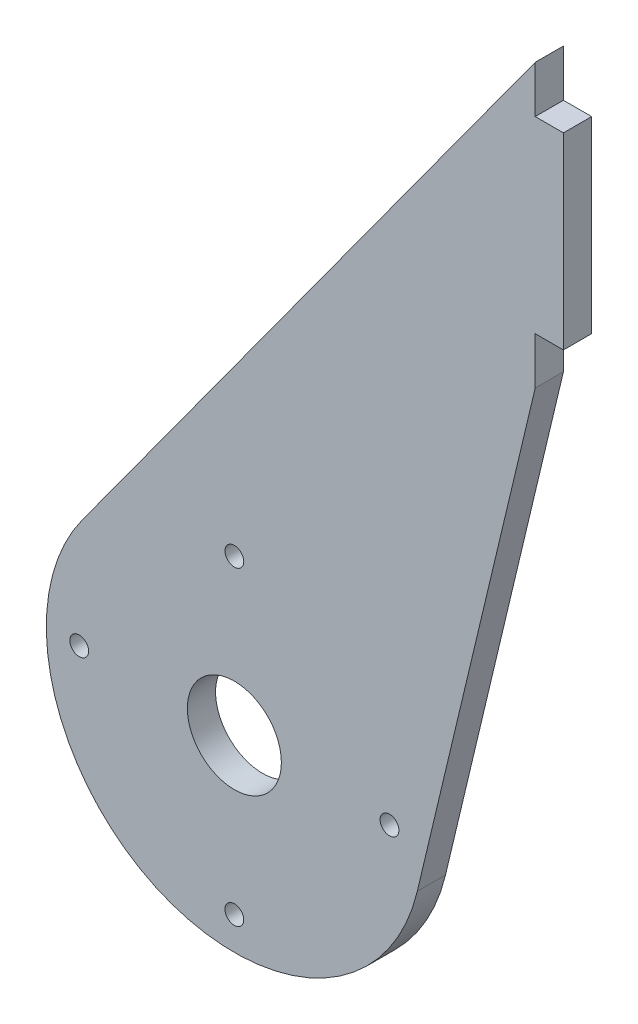
ISO-10303-21;
HEADER;
FILE_DESCRIPTION(('STEP AP214'),'2;1');
FILE_NAME('part.step','',(''),(''),'','','');
FILE_SCHEMA(('AUTOMOTIVE_DESIGN { 1 0 10303 214 1 1 1 1 }'));
ENDSEC;
DATA;
#1=APPLICATION_CONTEXT('core data for automotive mechanical design processes');
#2=APPLICATION_PROTOCOL_DEFINITION('international standard','automotive_design',2000,#1);
#3=PRODUCT_CONTEXT('',#1,'mechanical');
#4=PRODUCT('Part','Part','',(#3));
#5=PRODUCT_RELATED_PRODUCT_CATEGORY('part','',(#4));
#6=PRODUCT_DEFINITION_FORMATION('','',#4);
#7=PRODUCT_DEFINITION_CONTEXT('part definition',#1,'design');
#8=PRODUCT_DEFINITION('design','',#6,#7);
#9=PRODUCT_DEFINITION_SHAPE('','',#8);
#10=(LENGTH_UNIT() NAMED_UNIT(*) SI_UNIT(.MILLI.,.METRE.));
#11=(NAMED_UNIT(*) PLANE_ANGLE_UNIT() SI_UNIT($,.RADIAN.));
#12=(NAMED_UNIT(*) SI_UNIT($,.STERADIAN.) SOLID_ANGLE_UNIT());
#13=UNCERTAINTY_MEASURE_WITH_UNIT(LENGTH_MEASURE(1.E-05),#10,'distance_accuracy_value','');
#14=(GEOMETRIC_REPRESENTATION_CONTEXT(3) GLOBAL_UNCERTAINTY_ASSIGNED_CONTEXT((#13)) GLOBAL_UNIT_ASSIGNED_CONTEXT((#10,
#11,#12)) REPRESENTATION_CONTEXT('',''));
#15=CARTESIAN_POINT('',(0.,0.,0.));
#16=DIRECTION('',(0.,0.,1.));
#17=DIRECTION('',(1.,0.,0.));
#18=AXIS2_PLACEMENT_3D('',#15,#16,#17);
#19=CARTESIAN_POINT('',(32.,78.,-3.));
#20=DIRECTION('',(1.,0.,0.));
#21=DIRECTION('',(0.,0.,-1.));
#22=AXIS2_PLACEMENT_3D('',#19,#20,#21);
#23=PLANE('',#22);
#24=DIRECTION('',(0.,0.,1.));
#25=VECTOR('',#24,1.);
#26=CARTESIAN_POINT('',(32.,73.,0.));
#27=LINE('',#26,#25);
#28=CARTESIAN_POINT('',(32.,73.,-3.));
#29=VERTEX_POINT('',#28);
#30=CARTESIAN_POINT('',(32.,73.,0.));
#31=VERTEX_POINT('',#30);
#32=EDGE_CURVE('E50',#29,#31,#27,.T.);
#33=ORIENTED_EDGE('',*,*,#32,.F.);
#34=DIRECTION('',(0.,1.,0.));
#35=VECTOR('',#34,1.);
#36=CARTESIAN_POINT('',(32.,78.,-3.));
#37=LINE('',#36,#35);
#38=CARTESIAN_POINT('',(32.,78.,-3.));
#39=VERTEX_POINT('',#38);
#40=EDGE_CURVE('E180',#29,#39,#37,.T.);
#41=ORIENTED_EDGE('',*,*,#40,.T.);
#42=DIRECTION('',(0.,0.,1.));
#43=VECTOR('',#42,1.);
#44=CARTESIAN_POINT('',(32.,78.,-3.));
#45=LINE('',#44,#43);
#46=CARTESIAN_POINT('',(32.,78.,0.));
#47=VERTEX_POINT('',#46);
#48=EDGE_CURVE('E42',#39,#47,#45,.T.);
#49=ORIENTED_EDGE('',*,*,#48,.T.);
#50=DIRECTION('',(0.,1.,0.));
#51=VECTOR('',#50,1.);
#52=CARTESIAN_POINT('',(32.,78.,0.));
#53=LINE('',#52,#51);
#54=EDGE_CURVE('E55',#31,#47,#53,.T.);
#55=ORIENTED_EDGE('',*,*,#54,.F.);
#56=EDGE_LOOP('',(#33,#41,#49,#55));
#57=FACE_BOUND('',#56,.T.);
#58=ADVANCED_FACE('F33',(#57),#23,.T.);
#59=CARTESIAN_POINT('',(0.,0.,-3.));
#60=DIRECTION('',(0.,0.,1.));
#61=DIRECTION('',(1.,0.,0.));
#62=AXIS2_PLACEMENT_3D('',#59,#60,#61);
#63=CYLINDRICAL_SURFACE('',#62,20.);
#64=CARTESIAN_POINT('',(0.,0.,0.));
#65=DIRECTION('',(0.,0.,1.));
#66=DIRECTION('',(1.,0.,0.));
#67=AXIS2_PLACEMENT_3D('',#64,#65,#66);
#68=CIRCLE('',#67,20.);
#69=CARTESIAN_POINT('',(-16.1744111187009,11.7638609717747,0.));
#70=VERTEX_POINT('',#69);
#71=CARTESIAN_POINT('',(19.4550952982331,-4.63673019882206,0.));
#72=VERTEX_POINT('',#71);
#73=EDGE_CURVE('E170',#70,#72,#68,.T.);
#74=ORIENTED_EDGE('',*,*,#73,.F.);
#75=DIRECTION('',(0.,0.,1.));
#76=VECTOR('',#75,1.);
#77=CARTESIAN_POINT('',(-16.1744111187009,11.7638609717747,-3.));
#78=LINE('',#77,#76);
#79=CARTESIAN_POINT('',(-16.1744111187009,11.7638609717747,-3.));
#80=VERTEX_POINT('',#79);
#81=EDGE_CURVE('E11',#80,#70,#78,.T.);
#82=ORIENTED_EDGE('',*,*,#81,.F.);
#83=CARTESIAN_POINT('',(0.,0.,-3.));
#84=DIRECTION('',(0.,0.,1.));
#85=DIRECTION('',(1.,0.,0.));
#86=AXIS2_PLACEMENT_3D('',#83,#84,#85);
#87=CIRCLE('',#86,20.);
#88=CARTESIAN_POINT('',(19.4550952982331,-4.63673019882206,-3.));
#89=VERTEX_POINT('',#88);
#90=EDGE_CURVE('E173',#80,#89,#87,.T.);
#91=ORIENTED_EDGE('',*,*,#90,.T.);
#92=DIRECTION('',(0.,0.,1.));
#93=VECTOR('',#92,1.);
#94=CARTESIAN_POINT('',(19.4550952982331,-4.63673019882206,-3.));
#95=LINE('',#94,#93);
#96=EDGE_CURVE('E203',#89,#72,#95,.T.);
#97=ORIENTED_EDGE('',*,*,#96,.T.);
#98=EDGE_LOOP('',(#74,#82,#91,#97));
#99=FACE_BOUND('',#98,.T.);
#100=ADVANCED_FACE('F35',(#99),#63,.T.);
#101=CARTESIAN_POINT('',(-16.1744111187009,11.7638609717747,-3.));
#102=DIRECTION('',(-0.808720555935045,0.588193048588736,0.));
#103=DIRECTION('',(-0.588193048588736,-0.808720555935045,0.));
#104=AXIS2_PLACEMENT_3D('',#101,#102,#103);
#105=PLANE('',#104);
#106=DIRECTION('',(-0.588193048588736,-0.808720555935045,0.));
#107=VECTOR('',#106,1.);
#108=CARTESIAN_POINT('',(-16.1744111187009,11.7638609717747,0.));
#109=LINE('',#108,#107);
#110=EDGE_CURVE('E177',#47,#70,#109,.T.);
#111=ORIENTED_EDGE('',*,*,#110,.F.);
#112=ORIENTED_EDGE('',*,*,#48,.F.);
#113=DIRECTION('',(-0.588193048588736,-0.808720555935045,0.));
#114=VECTOR('',#113,1.);
#115=CARTESIAN_POINT('',(-16.1744111187009,11.7638609717747,-3.));
#116=LINE('',#115,#114);
#117=EDGE_CURVE('E183',#39,#80,#116,.T.);
#118=ORIENTED_EDGE('',*,*,#117,.T.);
#119=ORIENTED_EDGE('',*,*,#81,.T.);
#120=EDGE_LOOP('',(#111,#112,#118,#119));
#121=FACE_BOUND('',#120,.T.);
#122=ADVANCED_FACE('F212',(#121),#105,.T.);
#123=DIRECTION('',(0.,0.,-1.));
#124=VECTOR('',#123,1.);
#125=CARTESIAN_POINT('',(32.,53.,0.));
#126=LINE('',#125,#124);
#127=CARTESIAN_POINT('',(32.,53.,0.));
#128=VERTEX_POINT('',#127);
#129=CARTESIAN_POINT('',(32.,53.,-3.));
#130=VERTEX_POINT('',#129);
#131=EDGE_CURVE('E138',#128,#130,#126,.T.);
#132=ORIENTED_EDGE('',*,*,#131,.F.);
#133=CARTESIAN_POINT('',(32.,48.,0.));
#134=VERTEX_POINT('',#133);
#135=EDGE_CURVE('E123',#134,#128,#53,.T.);
#136=ORIENTED_EDGE('',*,*,#135,.F.);
#137=DIRECTION('',(0.,0.,1.));
#138=VECTOR('',#137,1.);
#139=CARTESIAN_POINT('',(32.,48.,-3.));
#140=LINE('',#139,#138);
#141=CARTESIAN_POINT('',(32.,48.,-3.));
#142=VERTEX_POINT('',#141);
#143=EDGE_CURVE('E202',#142,#134,#140,.T.);
#144=ORIENTED_EDGE('',*,*,#143,.F.);
#145=EDGE_CURVE('E189',#142,#130,#37,.T.);
#146=ORIENTED_EDGE('',*,*,#145,.T.);
#147=EDGE_LOOP('',(#132,#136,#144,#146));
#148=FACE_BOUND('',#147,.T.);
#149=ADVANCED_FACE('F222',(#148),#23,.T.);
#150=CARTESIAN_POINT('',(32.,48.,-3.));
#151=DIRECTION('',(0.972754764911655,-0.231836509941103,0.));
#152=DIRECTION('',(0.231836509941103,0.972754764911655,0.));
#153=AXIS2_PLACEMENT_3D('',#150,#151,#152);
#154=PLANE('',#153);
#155=DIRECTION('',(0.231836509941103,0.972754764911655,0.));
#156=VECTOR('',#155,1.);
#157=CARTESIAN_POINT('',(32.,48.,0.));
#158=LINE('',#157,#156);
#159=EDGE_CURVE('E193',#72,#134,#158,.T.);
#160=ORIENTED_EDGE('',*,*,#159,.F.);
#161=ORIENTED_EDGE('',*,*,#96,.F.);
#162=DIRECTION('',(0.231836509941103,0.972754764911655,0.));
#163=VECTOR('',#162,1.);
#164=CARTESIAN_POINT('',(32.,48.,-3.));
#165=LINE('',#164,#163);
#166=EDGE_CURVE('E176',#89,#142,#165,.T.);
#167=ORIENTED_EDGE('',*,*,#166,.T.);
#168=ORIENTED_EDGE('',*,*,#143,.T.);
#169=EDGE_LOOP('',(#160,#161,#167,#168));
#170=FACE_BOUND('',#169,.T.);
#171=ADVANCED_FACE('F228',(#170),#154,.T.);
#172=CARTESIAN_POINT('',(0.,0.,-3.));
#173=DIRECTION('',(0.,0.,1.));
#174=DIRECTION('',(1.,0.,0.));
#175=AXIS2_PLACEMENT_3D('',#172,#173,#174);
#176=PLANE('',#175);
#177=CARTESIAN_POINT('',(0.,0.,-3.));
#178=DIRECTION('',(0.,0.,1.));
#179=DIRECTION('',(1.,0.,0.));
#180=AXIS2_PLACEMENT_3D('',#177,#178,#179);
#181=CIRCLE('',#180,5.);
#182=CARTESIAN_POINT('',(5.,0.,-3.));
#183=VERTEX_POINT('',#182);
#184=EDGE_CURVE('E127',#183,#183,#181,.T.);
#185=ORIENTED_EDGE('',*,*,#184,.T.);
#186=EDGE_LOOP('',(#185));
#187=FACE_BOUND('',#186,.T.);
#188=CARTESIAN_POINT('',(16.5,0.,-3.));
#189=DIRECTION('',(0.,0.,1.));
#190=DIRECTION('',(1.,0.,0.));
#191=AXIS2_PLACEMENT_3D('',#188,#189,#190);
#192=CIRCLE('',#191,1.);
#193=CARTESIAN_POINT('',(17.5,0.,-3.));
#194=VERTEX_POINT('',#193);
#195=EDGE_CURVE('E149',#194,#194,#192,.T.);
#196=ORIENTED_EDGE('',*,*,#195,.T.);
#197=EDGE_LOOP('',(#196));
#198=FACE_BOUND('',#197,.T.);
#199=CARTESIAN_POINT('',(0.,-16.5,-3.));
#200=DIRECTION('',(0.,0.,1.));
#201=DIRECTION('',(1.,0.,0.));
#202=AXIS2_PLACEMENT_3D('',#199,#200,#201);
#203=CIRCLE('',#202,1.);
#204=CARTESIAN_POINT('',(1.,-16.5,-3.));
#205=VERTEX_POINT('',#204);
#206=EDGE_CURVE('E155',#205,#205,#203,.T.);
#207=ORIENTED_EDGE('',*,*,#206,.T.);
#208=EDGE_LOOP('',(#207));
#209=FACE_BOUND('',#208,.T.);
#210=CARTESIAN_POINT('',(-16.5,0.,-3.));
#211=DIRECTION('',(0.,0.,1.));
#212=DIRECTION('',(1.,0.,0.));
#213=AXIS2_PLACEMENT_3D('',#210,#211,#212);
#214=CIRCLE('',#213,1.);
#215=CARTESIAN_POINT('',(-15.5,0.,-3.));
#216=VERTEX_POINT('',#215);
#217=EDGE_CURVE('E161',#216,#216,#214,.T.);
#218=ORIENTED_EDGE('',*,*,#217,.T.);
#219=EDGE_LOOP('',(#218));
#220=FACE_BOUND('',#219,.T.);
#221=CARTESIAN_POINT('',(0.,16.5,-3.));
#222=DIRECTION('',(0.,0.,1.));
#223=DIRECTION('',(1.,0.,0.));
#224=AXIS2_PLACEMENT_3D('',#221,#222,#223);
#225=CIRCLE('',#224,1.);
#226=CARTESIAN_POINT('',(1.,16.5,-3.));
#227=VERTEX_POINT('',#226);
#228=EDGE_CURVE('E167',#227,#227,#225,.T.);
#229=ORIENTED_EDGE('',*,*,#228,.T.);
#230=EDGE_LOOP('',(#229));
#231=FACE_BOUND('',#230,.T.);
#232=ORIENTED_EDGE('',*,*,#90,.F.);
#233=ORIENTED_EDGE('',*,*,#117,.F.);
#234=ORIENTED_EDGE('',*,*,#40,.F.);
#235=DIRECTION('',(-1.,0.,0.));
#236=VECTOR('',#235,1.);
#237=CARTESIAN_POINT('',(35.,73.,-3.));
#238=LINE('',#237,#236);
#239=CARTESIAN_POINT('',(35.,73.,-3.));
#240=VERTEX_POINT('',#239);
#241=EDGE_CURVE('E129',#240,#29,#238,.T.);
#242=ORIENTED_EDGE('',*,*,#241,.F.);
#243=DIRECTION('',(0.,1.,0.));
#244=VECTOR('',#243,1.);
#245=CARTESIAN_POINT('',(35.,73.,-3.));
#246=LINE('',#245,#244);
#247=CARTESIAN_POINT('',(35.,53.,-3.));
#248=VERTEX_POINT('',#247);
#249=EDGE_CURVE('E107',#248,#240,#246,.T.);
#250=ORIENTED_EDGE('',*,*,#249,.F.);
#251=DIRECTION('',(-1.,0.,0.));
#252=VECTOR('',#251,1.);
#253=CARTESIAN_POINT('',(35.,53.,-3.));
#254=LINE('',#253,#252);
#255=EDGE_CURVE('E104',#248,#130,#254,.T.);
#256=ORIENTED_EDGE('',*,*,#255,.T.);
#257=ORIENTED_EDGE('',*,*,#145,.F.);
#258=ORIENTED_EDGE('',*,*,#166,.F.);
#259=EDGE_LOOP('',(#232,#233,#234,#242,#250,#256,#257,#258));
#260=FACE_BOUND('',#259,.T.);
#261=ADVANCED_FACE('F215',(#187,#198,#209,#220,#231,#260),#176,.F.);
#262=CARTESIAN_POINT('',(0.,0.,0.));
#263=DIRECTION('',(0.,0.,1.));
#264=DIRECTION('',(1.,0.,0.));
#265=AXIS2_PLACEMENT_3D('',#262,#263,#264);
#266=PLANE('',#265);
#267=CARTESIAN_POINT('',(0.,0.,0.));
#268=DIRECTION('',(0.,0.,1.));
#269=DIRECTION('',(1.,0.,0.));
#270=AXIS2_PLACEMENT_3D('',#267,#268,#269);
#271=CIRCLE('',#270,5.);
#272=CARTESIAN_POINT('',(5.,0.,0.));
#273=VERTEX_POINT('',#272);
#274=EDGE_CURVE('E124',#273,#273,#271,.T.);
#275=ORIENTED_EDGE('',*,*,#274,.F.);
#276=EDGE_LOOP('',(#275));
#277=FACE_BOUND('',#276,.T.);
#278=CARTESIAN_POINT('',(16.5,0.,0.));
#279=DIRECTION('',(0.,0.,1.));
#280=DIRECTION('',(1.,0.,0.));
#281=AXIS2_PLACEMENT_3D('',#278,#279,#280);
#282=CIRCLE('',#281,1.);
#283=CARTESIAN_POINT('',(17.5,0.,0.));
#284=VERTEX_POINT('',#283);
#285=EDGE_CURVE('E148',#284,#284,#282,.T.);
#286=ORIENTED_EDGE('',*,*,#285,.F.);
#287=EDGE_LOOP('',(#286));
#288=FACE_BOUND('',#287,.T.);
#289=CARTESIAN_POINT('',(0.,-16.5,0.));
#290=DIRECTION('',(0.,0.,1.));
#291=DIRECTION('',(1.,0.,0.));
#292=AXIS2_PLACEMENT_3D('',#289,#290,#291);
#293=CIRCLE('',#292,1.);
#294=CARTESIAN_POINT('',(1.,-16.5,0.));
#295=VERTEX_POINT('',#294);
#296=EDGE_CURVE('E152',#295,#295,#293,.T.);
#297=ORIENTED_EDGE('',*,*,#296,.F.);
#298=EDGE_LOOP('',(#297));
#299=FACE_BOUND('',#298,.T.);
#300=CARTESIAN_POINT('',(-16.5,0.,0.));
#301=DIRECTION('',(0.,0.,1.));
#302=DIRECTION('',(1.,0.,0.));
#303=AXIS2_PLACEMENT_3D('',#300,#301,#302);
#304=CIRCLE('',#303,1.);
#305=CARTESIAN_POINT('',(-15.5,0.,0.));
#306=VERTEX_POINT('',#305);
#307=EDGE_CURVE('E158',#306,#306,#304,.T.);
#308=ORIENTED_EDGE('',*,*,#307,.F.);
#309=EDGE_LOOP('',(#308));
#310=FACE_BOUND('',#309,.T.);
#311=CARTESIAN_POINT('',(0.,16.5,0.));
#312=DIRECTION('',(0.,0.,1.));
#313=DIRECTION('',(1.,0.,0.));
#314=AXIS2_PLACEMENT_3D('',#311,#312,#313);
#315=CIRCLE('',#314,1.);
#316=CARTESIAN_POINT('',(1.,16.5,0.));
#317=VERTEX_POINT('',#316);
#318=EDGE_CURVE('E164',#317,#317,#315,.T.);
#319=ORIENTED_EDGE('',*,*,#318,.F.);
#320=EDGE_LOOP('',(#319));
#321=FACE_BOUND('',#320,.T.);
#322=ORIENTED_EDGE('',*,*,#73,.T.);
#323=ORIENTED_EDGE('',*,*,#159,.T.);
#324=ORIENTED_EDGE('',*,*,#135,.T.);
#325=DIRECTION('',(-1.,0.,0.));
#326=VECTOR('',#325,1.);
#327=CARTESIAN_POINT('',(35.,53.,0.));
#328=LINE('',#327,#326);
#329=CARTESIAN_POINT('',(35.,53.,0.));
#330=VERTEX_POINT('',#329);
#331=EDGE_CURVE('E102',#330,#128,#328,.T.);
#332=ORIENTED_EDGE('',*,*,#331,.F.);
#333=DIRECTION('',(0.,-1.,0.));
#334=VECTOR('',#333,1.);
#335=CARTESIAN_POINT('',(35.,73.,0.));
#336=LINE('',#335,#334);
#337=CARTESIAN_POINT('',(35.,73.,0.));
#338=VERTEX_POINT('',#337);
#339=EDGE_CURVE('E108',#338,#330,#336,.T.);
#340=ORIENTED_EDGE('',*,*,#339,.F.);
#341=DIRECTION('',(-1.,0.,0.));
#342=VECTOR('',#341,1.);
#343=CARTESIAN_POINT('',(35.,73.,0.));
#344=LINE('',#343,#342);
#345=EDGE_CURVE('E139',#338,#31,#344,.T.);
#346=ORIENTED_EDGE('',*,*,#345,.T.);
#347=ORIENTED_EDGE('',*,*,#54,.T.);
#348=ORIENTED_EDGE('',*,*,#110,.T.);
#349=EDGE_LOOP('',(#322,#323,#324,#332,#340,#346,#347,#348));
#350=FACE_BOUND('',#349,.T.);
#351=ADVANCED_FACE('F120',(#277,#288,#299,#310,#321,#350),#266,.T.);
#352=CARTESIAN_POINT('',(0.,16.5,-3.));
#353=DIRECTION('',(0.,0.,1.));
#354=DIRECTION('',(1.,0.,0.));
#355=AXIS2_PLACEMENT_3D('',#352,#353,#354);
#356=CYLINDRICAL_SURFACE('',#355,1.);
#357=ORIENTED_EDGE('',*,*,#228,.F.);
#358=EDGE_LOOP('',(#357));
#359=FACE_BOUND('',#358,.T.);
#360=ORIENTED_EDGE('',*,*,#318,.T.);
#361=EDGE_LOOP('',(#360));
#362=FACE_BOUND('',#361,.T.);
#363=ADVANCED_FACE('F263',(#359,#362),#356,.F.);
#364=CARTESIAN_POINT('',(-16.5,0.,-3.));
#365=DIRECTION('',(0.,0.,1.));
#366=DIRECTION('',(1.,0.,0.));
#367=AXIS2_PLACEMENT_3D('',#364,#365,#366);
#368=CYLINDRICAL_SURFACE('',#367,1.);
#369=ORIENTED_EDGE('',*,*,#217,.F.);
#370=EDGE_LOOP('',(#369));
#371=FACE_BOUND('',#370,.T.);
#372=ORIENTED_EDGE('',*,*,#307,.T.);
#373=EDGE_LOOP('',(#372));
#374=FACE_BOUND('',#373,.T.);
#375=ADVANCED_FACE('F259',(#371,#374),#368,.F.);
#376=CARTESIAN_POINT('',(0.,-16.5,-3.));
#377=DIRECTION('',(0.,0.,1.));
#378=DIRECTION('',(1.,0.,0.));
#379=AXIS2_PLACEMENT_3D('',#376,#377,#378);
#380=CYLINDRICAL_SURFACE('',#379,1.);
#381=ORIENTED_EDGE('',*,*,#206,.F.);
#382=EDGE_LOOP('',(#381));
#383=FACE_BOUND('',#382,.T.);
#384=ORIENTED_EDGE('',*,*,#296,.T.);
#385=EDGE_LOOP('',(#384));
#386=FACE_BOUND('',#385,.T.);
#387=ADVANCED_FACE('F255',(#383,#386),#380,.F.);
#388=CARTESIAN_POINT('',(16.5,0.,-3.));
#389=DIRECTION('',(0.,0.,1.));
#390=DIRECTION('',(1.,0.,0.));
#391=AXIS2_PLACEMENT_3D('',#388,#389,#390);
#392=CYLINDRICAL_SURFACE('',#391,1.);
#393=ORIENTED_EDGE('',*,*,#195,.F.);
#394=EDGE_LOOP('',(#393));
#395=FACE_BOUND('',#394,.T.);
#396=ORIENTED_EDGE('',*,*,#285,.T.);
#397=EDGE_LOOP('',(#396));
#398=FACE_BOUND('',#397,.T.);
#399=ADVANCED_FACE('F251',(#395,#398),#392,.F.);
#400=CARTESIAN_POINT('',(0.,0.,-10.));
#401=DIRECTION('',(0.,0.,1.));
#402=DIRECTION('',(1.,0.,0.));
#403=AXIS2_PLACEMENT_3D('',#400,#401,#402);
#404=CYLINDRICAL_SURFACE('',#403,5.);
#405=ORIENTED_EDGE('',*,*,#274,.T.);
#406=EDGE_LOOP('',(#405));
#407=FACE_BOUND('',#406,.T.);
#408=ORIENTED_EDGE('',*,*,#184,.F.);
#409=EDGE_LOOP('',(#408));
#410=FACE_BOUND('',#409,.T.);
#411=ADVANCED_FACE('F246',(#407,#410),#404,.F.);
#412=CARTESIAN_POINT('',(35.,53.,0.));
#413=DIRECTION('',(0.,1.,0.));
#414=DIRECTION('',(0.,0.,1.));
#415=AXIS2_PLACEMENT_3D('',#412,#413,#414);
#416=PLANE('',#415);
#417=ORIENTED_EDGE('',*,*,#131,.T.);
#418=ORIENTED_EDGE('',*,*,#255,.F.);
#419=DIRECTION('',(0.,0.,-1.));
#420=VECTOR('',#419,1.);
#421=CARTESIAN_POINT('',(35.,53.,0.));
#422=LINE('',#421,#420);
#423=EDGE_CURVE('E97',#330,#248,#422,.T.);
#424=ORIENTED_EDGE('',*,*,#423,.F.);
#425=ORIENTED_EDGE('',*,*,#331,.T.);
#426=EDGE_LOOP('',(#417,#418,#424,#425));
#427=FACE_BOUND('',#426,.T.);
#428=ADVANCED_FACE('F100',(#427),#416,.F.);
#429=CARTESIAN_POINT('',(35.,73.,0.));
#430=DIRECTION('',(0.,-1.,0.));
#431=DIRECTION('',(0.,0.,-1.));
#432=AXIS2_PLACEMENT_3D('',#429,#430,#431);
#433=PLANE('',#432);
#434=ORIENTED_EDGE('',*,*,#32,.T.);
#435=ORIENTED_EDGE('',*,*,#345,.F.);
#436=DIRECTION('',(0.,0.,1.));
#437=VECTOR('',#436,1.);
#438=CARTESIAN_POINT('',(35.,73.,0.));
#439=LINE('',#438,#437);
#440=EDGE_CURVE('E113',#240,#338,#439,.T.);
#441=ORIENTED_EDGE('',*,*,#440,.F.);
#442=ORIENTED_EDGE('',*,*,#241,.T.);
#443=EDGE_LOOP('',(#434,#435,#441,#442));
#444=FACE_BOUND('',#443,.T.);
#445=ADVANCED_FACE('F238',(#444),#433,.F.);
#446=CARTESIAN_POINT('',(35.,0.,0.));
#447=DIRECTION('',(1.,0.,0.));
#448=DIRECTION('',(0.,0.,-1.));
#449=AXIS2_PLACEMENT_3D('',#446,#447,#448);
#450=PLANE('',#449);
#451=ORIENTED_EDGE('',*,*,#339,.T.);
#452=ORIENTED_EDGE('',*,*,#423,.T.);
#453=ORIENTED_EDGE('',*,*,#249,.T.);
#454=ORIENTED_EDGE('',*,*,#440,.T.);
#455=EDGE_LOOP('',(#451,#452,#453,#454));
#456=FACE_BOUND('',#455,.T.);
#457=ADVANCED_FACE('F111',(#456),#450,.T.);
#458=CLOSED_SHELL('',(#58,#100,#122,#149,#171,#261,#351,#363,#375,#387,#399,#411,#428,#445,#457));
#459=MANIFOLD_SOLID_BREP('B2',#458);
#460=ADVANCED_BREP_SHAPE_REPRESENTATION('',(#18,#459),#14);
#461=SHAPE_DEFINITION_REPRESENTATION(#9,#460);
ENDSEC;
END-ISO-10303-21;
